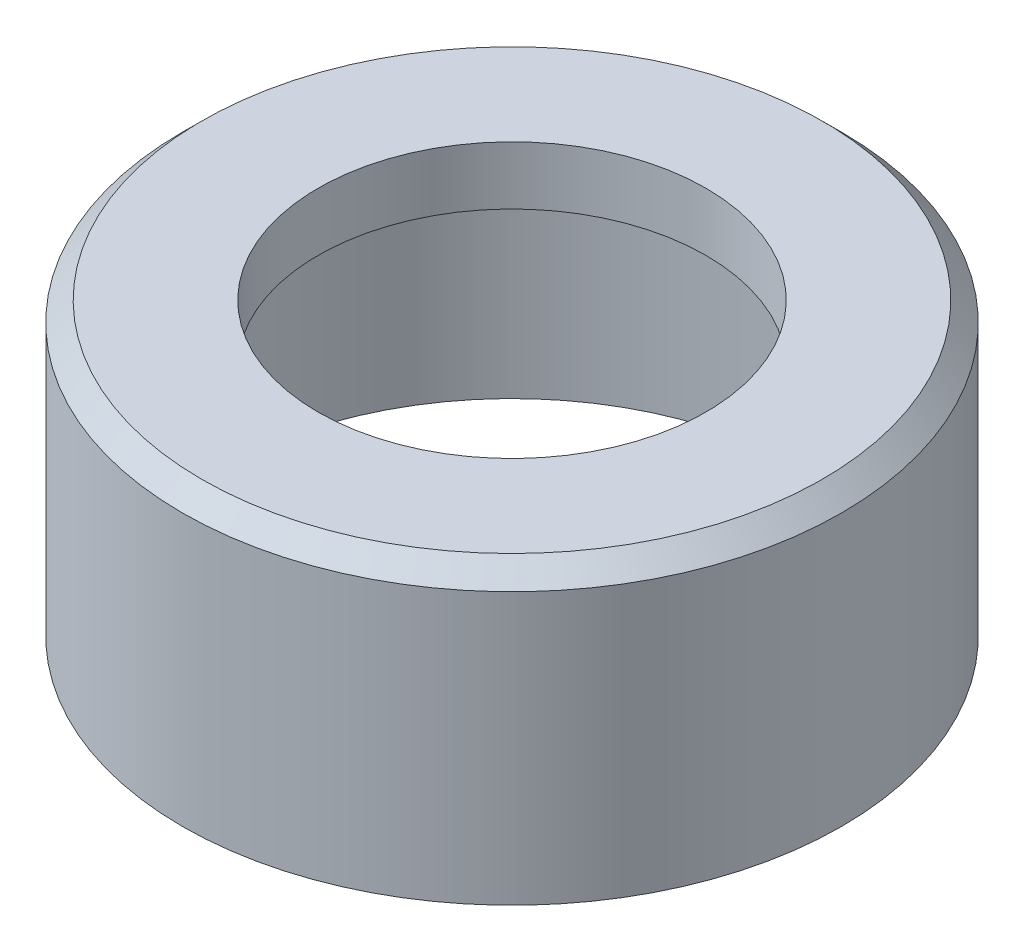
ISO-10303-21;
HEADER;
FILE_DESCRIPTION(('STEP AP214'),'2;1');
FILE_NAME('part.step','',(''),(''),'','','');
FILE_SCHEMA(('AUTOMOTIVE_DESIGN { 1 0 10303 214 1 1 1 1 }'));
ENDSEC;
DATA;
#1=APPLICATION_CONTEXT('core data for automotive mechanical design processes');
#2=APPLICATION_PROTOCOL_DEFINITION('international standard','automotive_design',2000,#1);
#3=PRODUCT_CONTEXT('',#1,'mechanical');
#4=PRODUCT('Part','Part','',(#3));
#5=PRODUCT_RELATED_PRODUCT_CATEGORY('part','',(#4));
#6=PRODUCT_DEFINITION_FORMATION('','',#4);
#7=PRODUCT_DEFINITION_CONTEXT('part definition',#1,'design');
#8=PRODUCT_DEFINITION('design','',#6,#7);
#9=PRODUCT_DEFINITION_SHAPE('','',#8);
#10=(LENGTH_UNIT() NAMED_UNIT(*) SI_UNIT(.MILLI.,.METRE.));
#11=(NAMED_UNIT(*) PLANE_ANGLE_UNIT() SI_UNIT($,.RADIAN.));
#12=(NAMED_UNIT(*) SI_UNIT($,.STERADIAN.) SOLID_ANGLE_UNIT());
#13=UNCERTAINTY_MEASURE_WITH_UNIT(LENGTH_MEASURE(1.E-05),#10,'distance_accuracy_value','');
#14=(GEOMETRIC_REPRESENTATION_CONTEXT(3) GLOBAL_UNCERTAINTY_ASSIGNED_CONTEXT((#13)) GLOBAL_UNIT_ASSIGNED_CONTEXT((#10,
#11,#12)) REPRESENTATION_CONTEXT('',''));
#15=CARTESIAN_POINT('',(0.,0.,0.));
#16=DIRECTION('',(0.,0.,1.));
#17=DIRECTION('',(1.,0.,0.));
#18=AXIS2_PLACEMENT_3D('',#15,#16,#17);
#19=CARTESIAN_POINT('',(0.,0.,0.));
#20=DIRECTION('',(0.,1.,0.));
#21=DIRECTION('',(0.,0.,1.));
#22=AXIS2_PLACEMENT_3D('',#19,#20,#21);
#23=PLANE('',#22);
#24=CARTESIAN_POINT('',(0.,0.,0.));
#25=DIRECTION('',(0.,1.,0.));
#26=DIRECTION('',(0.,0.,1.));
#27=AXIS2_PLACEMENT_3D('',#24,#25,#26);
#28=CIRCLE('',#27,8.5);
#29=CARTESIAN_POINT('',(0.,0.,8.5));
#30=VERTEX_POINT('',#29);
#31=EDGE_CURVE('E44',#30,#30,#28,.T.);
#32=ORIENTED_EDGE('',*,*,#31,.F.);
#33=EDGE_LOOP('',(#32));
#34=FACE_BOUND('',#33,.T.);
#35=CARTESIAN_POINT('',(0.,0.,0.));
#36=DIRECTION('',(0.,1.,0.));
#37=DIRECTION('',(0.,0.,1.));
#38=AXIS2_PLACEMENT_3D('',#35,#36,#37);
#39=CIRCLE('',#38,7.5);
#40=CARTESIAN_POINT('',(0.,0.,7.5));
#41=VERTEX_POINT('',#40);
#42=EDGE_CURVE('E48',#41,#41,#39,.T.);
#43=ORIENTED_EDGE('',*,*,#42,.T.);
#44=EDGE_LOOP('',(#43));
#45=FACE_BOUND('',#44,.T.);
#46=ADVANCED_FACE('F32',(#34,#45),#23,.F.);
#47=CARTESIAN_POINT('',(0.,6.,0.));
#48=DIRECTION('',(0.,-1.,0.));
#49=DIRECTION('',(0.,0.,-1.));
#50=AXIS2_PLACEMENT_3D('',#47,#48,#49);
#51=CYLINDRICAL_SURFACE('',#50,8.5);
#52=CARTESIAN_POINT('',(0.,7.,0.));
#53=DIRECTION('',(0.,1.,0.));
#54=DIRECTION('',(0.,0.,1.));
#55=AXIS2_PLACEMENT_3D('',#52,#53,#54);
#56=CIRCLE('',#55,8.5);
#57=CARTESIAN_POINT('',(0.,7.,8.5));
#58=VERTEX_POINT('',#57);
#59=EDGE_CURVE('E10',#58,#58,#56,.F.);
#60=ORIENTED_EDGE('',*,*,#59,.T.);
#61=EDGE_LOOP('',(#60));
#62=FACE_BOUND('',#61,.T.);
#63=ORIENTED_EDGE('',*,*,#31,.T.);
#64=EDGE_LOOP('',(#63));
#65=FACE_BOUND('',#64,.T.);
#66=ADVANCED_FACE('F79',(#62,#65),#51,.T.);
#67=CARTESIAN_POINT('',(0.,6.,0.));
#68=DIRECTION('',(0.,-1.,0.));
#69=DIRECTION('',(0.,0.,-1.));
#70=AXIS2_PLACEMENT_3D('',#67,#68,#69);
#71=CYLINDRICAL_SURFACE('',#70,7.5);
#72=CARTESIAN_POINT('',(0.,6.,0.));
#73=DIRECTION('',(0.,1.,0.));
#74=DIRECTION('',(0.,0.,1.));
#75=AXIS2_PLACEMENT_3D('',#72,#73,#74);
#76=CIRCLE('',#75,7.5);
#77=CARTESIAN_POINT('',(0.,6.,7.5));
#78=VERTEX_POINT('',#77);
#79=EDGE_CURVE('E53',#78,#78,#76,.T.);
#80=ORIENTED_EDGE('',*,*,#79,.T.);
#81=EDGE_LOOP('',(#80));
#82=FACE_BOUND('',#81,.T.);
#83=ORIENTED_EDGE('',*,*,#42,.F.);
#84=EDGE_LOOP('',(#83));
#85=FACE_BOUND('',#84,.T.);
#86=ADVANCED_FACE('F75',(#82,#85),#71,.F.);
#87=CARTESIAN_POINT('',(0.,6.,0.));
#88=DIRECTION('',(0.,1.,0.));
#89=DIRECTION('',(0.,0.,1.));
#90=AXIS2_PLACEMENT_3D('',#87,#88,#89);
#91=PLANE('',#90);
#92=CARTESIAN_POINT('',(0.,6.,0.));
#93=DIRECTION('',(0.,1.,0.));
#94=DIRECTION('',(0.,0.,1.));
#95=AXIS2_PLACEMENT_3D('',#92,#93,#94);
#96=CIRCLE('',#95,5.);
#97=CARTESIAN_POINT('',(0.,6.,5.));
#98=VERTEX_POINT('',#97);
#99=EDGE_CURVE('E57',#98,#98,#96,.T.);
#100=ORIENTED_EDGE('',*,*,#99,.T.);
#101=EDGE_LOOP('',(#100));
#102=FACE_BOUND('',#101,.T.);
#103=ORIENTED_EDGE('',*,*,#79,.F.);
#104=EDGE_LOOP('',(#103));
#105=FACE_BOUND('',#104,.T.);
#106=ADVANCED_FACE('F68',(#102,#105),#91,.F.);
#107=CARTESIAN_POINT('',(0.,7.5,0.));
#108=DIRECTION('',(0.,1.,0.));
#109=DIRECTION('',(0.,0.,1.));
#110=AXIS2_PLACEMENT_3D('',#107,#108,#109);
#111=PLANE('',#110);
#112=CARTESIAN_POINT('',(0.,7.5,0.));
#113=DIRECTION('',(0.,1.,0.));
#114=DIRECTION('',(0.,0.,1.));
#115=AXIS2_PLACEMENT_3D('',#112,#113,#114);
#116=CIRCLE('',#115,8.);
#117=CARTESIAN_POINT('',(0.,7.5,8.));
#118=VERTEX_POINT('',#117);
#119=EDGE_CURVE('E40',#118,#118,#116,.T.);
#120=ORIENTED_EDGE('',*,*,#119,.T.);
#121=EDGE_LOOP('',(#120));
#122=FACE_BOUND('',#121,.T.);
#123=CARTESIAN_POINT('',(0.,7.5,0.));
#124=DIRECTION('',(0.,1.,0.));
#125=DIRECTION('',(0.,0.,1.));
#126=AXIS2_PLACEMENT_3D('',#123,#124,#125);
#127=CIRCLE('',#126,5.);
#128=CARTESIAN_POINT('',(0.,7.5,5.));
#129=VERTEX_POINT('',#128);
#130=EDGE_CURVE('E56',#129,#129,#127,.T.);
#131=ORIENTED_EDGE('',*,*,#130,.F.);
#132=EDGE_LOOP('',(#131));
#133=FACE_BOUND('',#132,.T.);
#134=ADVANCED_FACE('F66',(#122,#133),#111,.T.);
#135=CARTESIAN_POINT('',(0.,7.5,0.));
#136=DIRECTION('',(0.,-1.,0.));
#137=DIRECTION('',(0.,0.,-1.));
#138=AXIS2_PLACEMENT_3D('',#135,#136,#137);
#139=CYLINDRICAL_SURFACE('',#138,5.);
#140=ORIENTED_EDGE('',*,*,#130,.T.);
#141=EDGE_LOOP('',(#140));
#142=FACE_BOUND('',#141,.T.);
#143=ORIENTED_EDGE('',*,*,#99,.F.);
#144=EDGE_LOOP('',(#143));
#145=FACE_BOUND('',#144,.T.);
#146=ADVANCED_FACE('F63',(#142,#145),#139,.F.);
#147=CARTESIAN_POINT('',(0.,7.5,0.));
#148=DIRECTION('',(0.,-1.,0.));
#149=DIRECTION('',(0.,0.,-1.));
#150=AXIS2_PLACEMENT_3D('',#147,#148,#149);
#151=CONICAL_SURFACE('',#150,8.,0.785398163397447);
#152=ORIENTED_EDGE('',*,*,#59,.F.);
#153=EDGE_LOOP('',(#152));
#154=FACE_BOUND('',#153,.T.);
#155=ORIENTED_EDGE('',*,*,#119,.F.);
#156=EDGE_LOOP('',(#155));
#157=FACE_BOUND('',#156,.T.);
#158=ADVANCED_FACE('F35',(#154,#157),#151,.T.);
#159=CLOSED_SHELL('',(#46,#66,#86,#106,#134,#146,#158));
#160=MANIFOLD_SOLID_BREP('B2',#159);
#161=ADVANCED_BREP_SHAPE_REPRESENTATION('',(#18,#160),#14);
#162=SHAPE_DEFINITION_REPRESENTATION(#9,#161);
ENDSEC;
END-ISO-10303-21;
